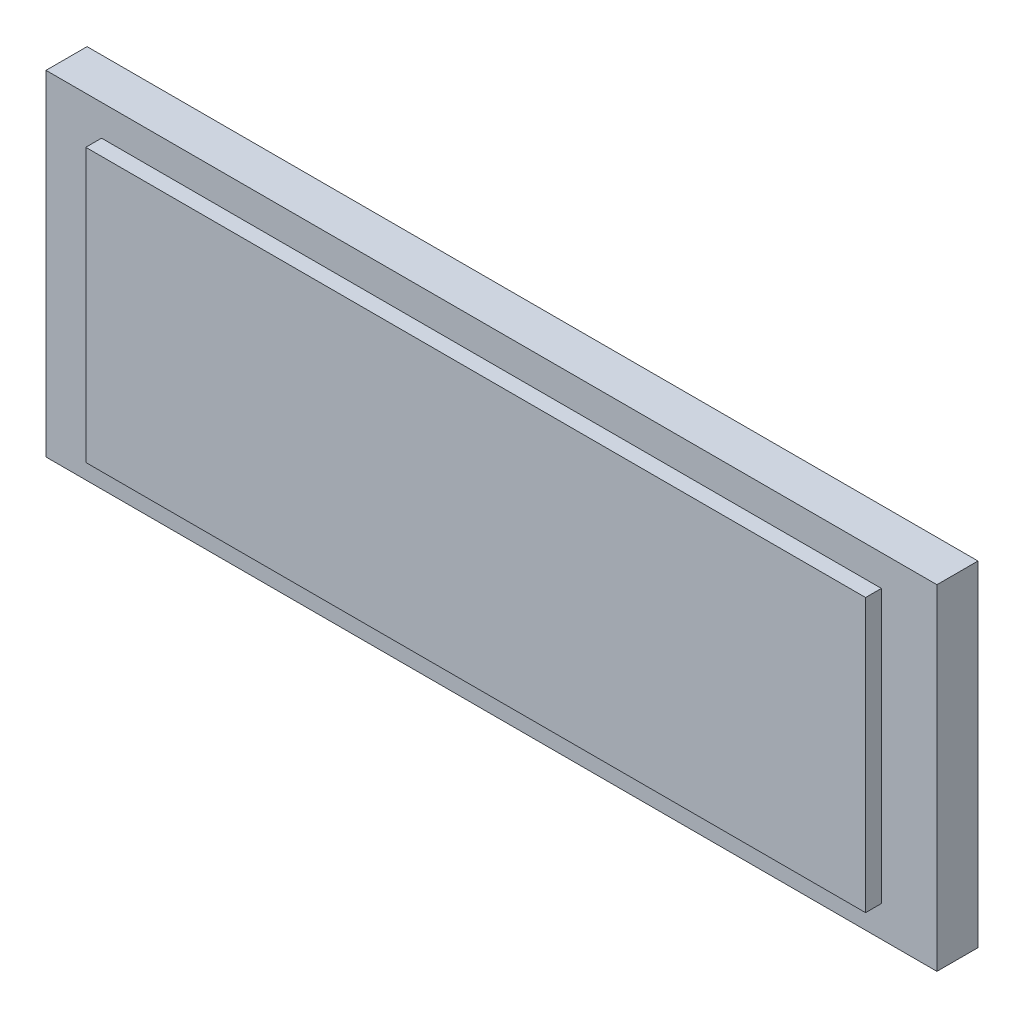
ISO-10303-21;
HEADER;
FILE_DESCRIPTION(('STEP AP214'),'2;1');
FILE_NAME('part.step','',(''),(''),'','','');
FILE_SCHEMA(('AUTOMOTIVE_DESIGN { 1 0 10303 214 1 1 1 1 }'));
ENDSEC;
DATA;
#1=APPLICATION_CONTEXT('core data for automotive mechanical design processes');
#2=APPLICATION_PROTOCOL_DEFINITION('international standard','automotive_design',2000,#1);
#3=PRODUCT_CONTEXT('',#1,'mechanical');
#4=PRODUCT('Part','Part','',(#3));
#5=PRODUCT_RELATED_PRODUCT_CATEGORY('part','',(#4));
#6=PRODUCT_DEFINITION_FORMATION('','',#4);
#7=PRODUCT_DEFINITION_CONTEXT('part definition',#1,'design');
#8=PRODUCT_DEFINITION('design','',#6,#7);
#9=PRODUCT_DEFINITION_SHAPE('','',#8);
#10=(LENGTH_UNIT() NAMED_UNIT(*) SI_UNIT(.MILLI.,.METRE.));
#11=(NAMED_UNIT(*) PLANE_ANGLE_UNIT() SI_UNIT($,.RADIAN.));
#12=(NAMED_UNIT(*) SI_UNIT($,.STERADIAN.) SOLID_ANGLE_UNIT());
#13=UNCERTAINTY_MEASURE_WITH_UNIT(LENGTH_MEASURE(1.E-05),#10,'distance_accuracy_value','');
#14=(GEOMETRIC_REPRESENTATION_CONTEXT(3) GLOBAL_UNCERTAINTY_ASSIGNED_CONTEXT((#13)) GLOBAL_UNIT_ASSIGNED_CONTEXT((#10,
#11,#12)) REPRESENTATION_CONTEXT('',''));
#15=CARTESIAN_POINT('',(0.,0.,0.));
#16=DIRECTION('',(0.,0.,1.));
#17=DIRECTION('',(1.,0.,0.));
#18=AXIS2_PLACEMENT_3D('',#15,#16,#17);
#19=CARTESIAN_POINT('',(0.,0.,3.302));
#20=DIRECTION('',(0.,0.,-1.));
#21=DIRECTION('',(-1.,0.,0.));
#22=AXIS2_PLACEMENT_3D('',#19,#20,#21);
#23=PLANE('',#22);
#24=DIRECTION('',(0.,-1.,0.));
#25=VECTOR('',#24,1.);
#26=CARTESIAN_POINT('',(0.,0.,3.302));
#27=LINE('',#26,#25);
#28=CARTESIAN_POINT('',(0.,26.924,3.302));
#29=VERTEX_POINT('',#28);
#30=CARTESIAN_POINT('',(0.,0.,3.302));
#31=VERTEX_POINT('',#30);
#32=EDGE_CURVE('E129',#29,#31,#27,.T.);
#33=ORIENTED_EDGE('',*,*,#32,.T.);
#34=DIRECTION('',(1.,0.,0.));
#35=VECTOR('',#34,1.);
#36=CARTESIAN_POINT('',(0.,0.,3.302));
#37=LINE('',#36,#35);
#38=CARTESIAN_POINT('',(71.628,0.,3.302));
#39=VERTEX_POINT('',#38);
#40=EDGE_CURVE('E132',#31,#39,#37,.T.);
#41=ORIENTED_EDGE('',*,*,#40,.T.);
#42=DIRECTION('',(0.,1.,0.));
#43=VECTOR('',#42,1.);
#44=CARTESIAN_POINT('',(71.628,0.,3.302));
#45=LINE('',#44,#43);
#46=CARTESIAN_POINT('',(71.628,26.924,3.302));
#47=VERTEX_POINT('',#46);
#48=EDGE_CURVE('E135',#39,#47,#45,.T.);
#49=ORIENTED_EDGE('',*,*,#48,.T.);
#50=DIRECTION('',(-1.,0.,0.));
#51=VECTOR('',#50,1.);
#52=CARTESIAN_POINT('',(0.,26.924,3.302));
#53=LINE('',#52,#51);
#54=EDGE_CURVE('E137',#47,#29,#53,.T.);
#55=ORIENTED_EDGE('',*,*,#54,.T.);
#56=EDGE_LOOP('',(#33,#41,#49,#55));
#57=FACE_BOUND('',#56,.T.);
#58=DIRECTION('',(0.,1.,0.));
#59=VECTOR('',#58,1.);
#60=CARTESIAN_POINT('',(67.1619469721964,24.4337814402687,3.302));
#61=LINE('',#60,#59);
#62=CARTESIAN_POINT('',(67.1619469721964,2.49021855973127,3.302));
#63=VERTEX_POINT('',#62);
#64=CARTESIAN_POINT('',(67.1619469721964,24.4337814402687,3.302));
#65=VERTEX_POINT('',#64);
#66=EDGE_CURVE('E50',#63,#65,#61,.T.);
#67=ORIENTED_EDGE('',*,*,#66,.F.);
#68=DIRECTION('',(1.,0.,0.));
#69=VECTOR('',#68,1.);
#70=CARTESIAN_POINT('',(4.46605302780359,2.49021855973127,3.302));
#71=LINE('',#70,#69);
#72=CARTESIAN_POINT('',(4.46605302780359,2.49021855973127,3.302));
#73=VERTEX_POINT('',#72);
#74=EDGE_CURVE('E54',#73,#63,#71,.T.);
#75=ORIENTED_EDGE('',*,*,#74,.F.);
#76=DIRECTION('',(0.,-1.,0.));
#77=VECTOR('',#76,1.);
#78=CARTESIAN_POINT('',(4.46605302780359,24.4337814402687,3.302));
#79=LINE('',#78,#77);
#80=CARTESIAN_POINT('',(4.46605302780359,24.4337814402687,3.302));
#81=VERTEX_POINT('',#80);
#82=EDGE_CURVE('E244',#81,#73,#79,.T.);
#83=ORIENTED_EDGE('',*,*,#82,.F.);
#84=DIRECTION('',(-1.,0.,0.));
#85=VECTOR('',#84,1.);
#86=CARTESIAN_POINT('',(4.46605302780359,24.4337814402687,3.302));
#87=LINE('',#86,#85);
#88=EDGE_CURVE('E250',#65,#81,#87,.T.);
#89=ORIENTED_EDGE('',*,*,#88,.F.);
#90=EDGE_LOOP('',(#67,#75,#83,#89));
#91=FACE_BOUND('',#90,.T.);
#92=ADVANCED_FACE('F35',(#57,#91),#23,.F.);
#93=CARTESIAN_POINT('',(0.,0.,3.302));
#94=DIRECTION('',(1.,0.,0.));
#95=DIRECTION('',(0.,0.,-1.));
#96=AXIS2_PLACEMENT_3D('',#93,#94,#95);
#97=PLANE('',#96);
#98=DIRECTION('',(0.,-1.,0.));
#99=VECTOR('',#98,1.);
#100=CARTESIAN_POINT('',(0.,0.,0.));
#101=LINE('',#100,#99);
#102=CARTESIAN_POINT('',(0.,26.924,0.));
#103=VERTEX_POINT('',#102);
#104=CARTESIAN_POINT('',(0.,0.,0.));
#105=VERTEX_POINT('',#104);
#106=EDGE_CURVE('E120',#103,#105,#101,.T.);
#107=ORIENTED_EDGE('',*,*,#106,.T.);
#108=DIRECTION('',(0.,0.,-1.));
#109=VECTOR('',#108,1.);
#110=CARTESIAN_POINT('',(0.,0.,3.302));
#111=LINE('',#110,#109);
#112=EDGE_CURVE('E11',#31,#105,#111,.T.);
#113=ORIENTED_EDGE('',*,*,#112,.F.);
#114=ORIENTED_EDGE('',*,*,#32,.F.);
#115=DIRECTION('',(0.,0.,-1.));
#116=VECTOR('',#115,1.);
#117=CARTESIAN_POINT('',(0.,26.924,3.302));
#118=LINE('',#117,#116);
#119=EDGE_CURVE('E138',#29,#103,#118,.T.);
#120=ORIENTED_EDGE('',*,*,#119,.T.);
#121=EDGE_LOOP('',(#107,#113,#114,#120));
#122=FACE_BOUND('',#121,.T.);
#123=ADVANCED_FACE('F37',(#122),#97,.F.);
#124=CARTESIAN_POINT('',(0.,0.,3.302));
#125=DIRECTION('',(0.,1.,0.));
#126=DIRECTION('',(0.,0.,1.));
#127=AXIS2_PLACEMENT_3D('',#124,#125,#126);
#128=PLANE('',#127);
#129=DIRECTION('',(1.,0.,0.));
#130=VECTOR('',#129,1.);
#131=CARTESIAN_POINT('',(0.,0.,0.));
#132=LINE('',#131,#130);
#133=CARTESIAN_POINT('',(71.628,0.,0.));
#134=VERTEX_POINT('',#133);
#135=EDGE_CURVE('E123',#105,#134,#132,.T.);
#136=ORIENTED_EDGE('',*,*,#135,.T.);
#137=DIRECTION('',(0.,0.,-1.));
#138=VECTOR('',#137,1.);
#139=CARTESIAN_POINT('',(71.628,0.,3.302));
#140=LINE('',#139,#138);
#141=EDGE_CURVE('E43',#39,#134,#140,.T.);
#142=ORIENTED_EDGE('',*,*,#141,.F.);
#143=ORIENTED_EDGE('',*,*,#40,.F.);
#144=ORIENTED_EDGE('',*,*,#112,.T.);
#145=EDGE_LOOP('',(#136,#142,#143,#144));
#146=FACE_BOUND('',#145,.T.);
#147=ADVANCED_FACE('F168',(#146),#128,.F.);
#148=CARTESIAN_POINT('',(71.628,0.,3.302));
#149=DIRECTION('',(-1.,0.,0.));
#150=DIRECTION('',(0.,0.,1.));
#151=AXIS2_PLACEMENT_3D('',#148,#149,#150);
#152=PLANE('',#151);
#153=DIRECTION('',(0.,1.,0.));
#154=VECTOR('',#153,1.);
#155=CARTESIAN_POINT('',(71.628,0.,0.));
#156=LINE('',#155,#154);
#157=CARTESIAN_POINT('',(71.628,26.924,0.));
#158=VERTEX_POINT('',#157);
#159=EDGE_CURVE('E141',#134,#158,#156,.T.);
#160=ORIENTED_EDGE('',*,*,#159,.T.);
#161=DIRECTION('',(0.,0.,-1.));
#162=VECTOR('',#161,1.);
#163=CARTESIAN_POINT('',(71.628,26.924,3.302));
#164=LINE('',#163,#162);
#165=EDGE_CURVE('E146',#47,#158,#164,.T.);
#166=ORIENTED_EDGE('',*,*,#165,.F.);
#167=ORIENTED_EDGE('',*,*,#48,.F.);
#168=ORIENTED_EDGE('',*,*,#141,.T.);
#169=EDGE_LOOP('',(#160,#166,#167,#168));
#170=FACE_BOUND('',#169,.T.);
#171=ADVANCED_FACE('F153',(#170),#152,.F.);
#172=CARTESIAN_POINT('',(0.,26.924,3.302));
#173=DIRECTION('',(0.,-1.,0.));
#174=DIRECTION('',(0.,0.,-1.));
#175=AXIS2_PLACEMENT_3D('',#172,#173,#174);
#176=PLANE('',#175);
#177=DIRECTION('',(-1.,0.,0.));
#178=VECTOR('',#177,1.);
#179=CARTESIAN_POINT('',(0.,26.924,0.));
#180=LINE('',#179,#178);
#181=EDGE_CURVE('E133',#158,#103,#180,.T.);
#182=ORIENTED_EDGE('',*,*,#181,.T.);
#183=ORIENTED_EDGE('',*,*,#119,.F.);
#184=ORIENTED_EDGE('',*,*,#54,.F.);
#185=ORIENTED_EDGE('',*,*,#165,.T.);
#186=EDGE_LOOP('',(#182,#183,#184,#185));
#187=FACE_BOUND('',#186,.T.);
#188=ADVANCED_FACE('F162',(#187),#176,.F.);
#189=CARTESIAN_POINT('',(0.,0.,0.));
#190=DIRECTION('',(0.,0.,-1.));
#191=DIRECTION('',(-1.,0.,0.));
#192=AXIS2_PLACEMENT_3D('',#189,#190,#191);
#193=PLANE('',#192);
#194=ORIENTED_EDGE('',*,*,#106,.F.);
#195=ORIENTED_EDGE('',*,*,#181,.F.);
#196=ORIENTED_EDGE('',*,*,#159,.F.);
#197=ORIENTED_EDGE('',*,*,#135,.F.);
#198=EDGE_LOOP('',(#194,#195,#196,#197));
#199=FACE_BOUND('',#198,.T.);
#200=ADVANCED_FACE('F159',(#199),#193,.T.);
#201=CARTESIAN_POINT('',(67.1619469721964,24.4337814402687,4.572));
#202=DIRECTION('',(-1.,0.,0.));
#203=DIRECTION('',(0.,0.,1.));
#204=AXIS2_PLACEMENT_3D('',#201,#202,#203);
#205=PLANE('',#204);
#206=ORIENTED_EDGE('',*,*,#66,.T.);
#207=DIRECTION('',(0.,0.,-1.));
#208=VECTOR('',#207,1.);
#209=CARTESIAN_POINT('',(67.1619469721964,24.4337814402687,4.572));
#210=LINE('',#209,#208);
#211=CARTESIAN_POINT('',(67.1619469721964,24.4337814402687,4.572));
#212=VERTEX_POINT('',#211);
#213=EDGE_CURVE('E103',#212,#65,#210,.T.);
#214=ORIENTED_EDGE('',*,*,#213,.F.);
#215=DIRECTION('',(0.,1.,0.));
#216=VECTOR('',#215,1.);
#217=CARTESIAN_POINT('',(67.1619469721964,24.4337814402687,4.572));
#218=LINE('',#217,#216);
#219=CARTESIAN_POINT('',(67.1619469721964,2.49021855973127,4.572));
#220=VERTEX_POINT('',#219);
#221=EDGE_CURVE('E109',#220,#212,#218,.T.);
#222=ORIENTED_EDGE('',*,*,#221,.F.);
#223=DIRECTION('',(0.,0.,-1.));
#224=VECTOR('',#223,1.);
#225=CARTESIAN_POINT('',(67.1619469721964,2.49021855973127,4.572));
#226=LINE('',#225,#224);
#227=EDGE_CURVE('E242',#220,#63,#226,.T.);
#228=ORIENTED_EDGE('',*,*,#227,.T.);
#229=EDGE_LOOP('',(#206,#214,#222,#228));
#230=FACE_BOUND('',#229,.T.);
#231=ADVANCED_FACE('F119',(#230),#205,.F.);
#232=CARTESIAN_POINT('',(4.46605302780359,24.4337814402687,4.572));
#233=DIRECTION('',(0.,-1.,0.));
#234=DIRECTION('',(0.,0.,-1.));
#235=AXIS2_PLACEMENT_3D('',#232,#233,#234);
#236=PLANE('',#235);
#237=ORIENTED_EDGE('',*,*,#88,.T.);
#238=DIRECTION('',(0.,0.,-1.));
#239=VECTOR('',#238,1.);
#240=CARTESIAN_POINT('',(4.46605302780359,24.4337814402687,4.572));
#241=LINE('',#240,#239);
#242=CARTESIAN_POINT('',(4.46605302780359,24.4337814402687,4.572));
#243=VERTEX_POINT('',#242);
#244=EDGE_CURVE('E105',#243,#81,#241,.T.);
#245=ORIENTED_EDGE('',*,*,#244,.F.);
#246=DIRECTION('',(-1.,0.,0.));
#247=VECTOR('',#246,1.);
#248=CARTESIAN_POINT('',(4.46605302780359,24.4337814402687,4.572));
#249=LINE('',#248,#247);
#250=EDGE_CURVE('E98',#212,#243,#249,.T.);
#251=ORIENTED_EDGE('',*,*,#250,.F.);
#252=ORIENTED_EDGE('',*,*,#213,.T.);
#253=EDGE_LOOP('',(#237,#245,#251,#252));
#254=FACE_BOUND('',#253,.T.);
#255=ADVANCED_FACE('F101',(#254),#236,.F.);
#256=CARTESIAN_POINT('',(4.46605302780359,24.4337814402687,4.572));
#257=DIRECTION('',(1.,0.,0.));
#258=DIRECTION('',(0.,0.,-1.));
#259=AXIS2_PLACEMENT_3D('',#256,#257,#258);
#260=PLANE('',#259);
#261=ORIENTED_EDGE('',*,*,#82,.T.);
#262=DIRECTION('',(0.,0.,-1.));
#263=VECTOR('',#262,1.);
#264=CARTESIAN_POINT('',(4.46605302780359,2.49021855973127,4.572));
#265=LINE('',#264,#263);
#266=CARTESIAN_POINT('',(4.46605302780359,2.49021855973127,4.572));
#267=VERTEX_POINT('',#266);
#268=EDGE_CURVE('E125',#267,#73,#265,.T.);
#269=ORIENTED_EDGE('',*,*,#268,.F.);
#270=DIRECTION('',(0.,-1.,0.));
#271=VECTOR('',#270,1.);
#272=CARTESIAN_POINT('',(4.46605302780359,24.4337814402687,4.572));
#273=LINE('',#272,#271);
#274=EDGE_CURVE('E108',#243,#267,#273,.T.);
#275=ORIENTED_EDGE('',*,*,#274,.F.);
#276=ORIENTED_EDGE('',*,*,#244,.T.);
#277=EDGE_LOOP('',(#261,#269,#275,#276));
#278=FACE_BOUND('',#277,.T.);
#279=ADVANCED_FACE('F208',(#278),#260,.F.);
#280=CARTESIAN_POINT('',(4.46605302780359,2.49021855973127,4.572));
#281=DIRECTION('',(0.,1.,0.));
#282=DIRECTION('',(0.,0.,1.));
#283=AXIS2_PLACEMENT_3D('',#280,#281,#282);
#284=PLANE('',#283);
#285=ORIENTED_EDGE('',*,*,#74,.T.);
#286=ORIENTED_EDGE('',*,*,#227,.F.);
#287=DIRECTION('',(1.,0.,0.));
#288=VECTOR('',#287,1.);
#289=CARTESIAN_POINT('',(4.46605302780359,2.49021855973127,4.572));
#290=LINE('',#289,#288);
#291=EDGE_CURVE('E114',#267,#220,#290,.T.);
#292=ORIENTED_EDGE('',*,*,#291,.F.);
#293=ORIENTED_EDGE('',*,*,#268,.T.);
#294=EDGE_LOOP('',(#285,#286,#292,#293));
#295=FACE_BOUND('',#294,.T.);
#296=ADVANCED_FACE('F214',(#295),#284,.F.);
#297=CARTESIAN_POINT('',(0.,0.,4.572));
#298=DIRECTION('',(0.,0.,1.));
#299=DIRECTION('',(1.,0.,0.));
#300=AXIS2_PLACEMENT_3D('',#297,#298,#299);
#301=PLANE('',#300);
#302=ORIENTED_EDGE('',*,*,#221,.T.);
#303=ORIENTED_EDGE('',*,*,#250,.T.);
#304=ORIENTED_EDGE('',*,*,#274,.T.);
#305=ORIENTED_EDGE('',*,*,#291,.T.);
#306=EDGE_LOOP('',(#302,#303,#304,#305));
#307=FACE_BOUND('',#306,.T.);
#308=ADVANCED_FACE('F112',(#307),#301,.T.);
#309=CLOSED_SHELL('',(#92,#123,#147,#171,#188,#200,#231,#255,#279,#296,#308));
#310=MANIFOLD_SOLID_BREP('B2',#309);
#311=ADVANCED_BREP_SHAPE_REPRESENTATION('',(#18,#310),#14);
#312=SHAPE_DEFINITION_REPRESENTATION(#9,#311);
ENDSEC;
END-ISO-10303-21;
